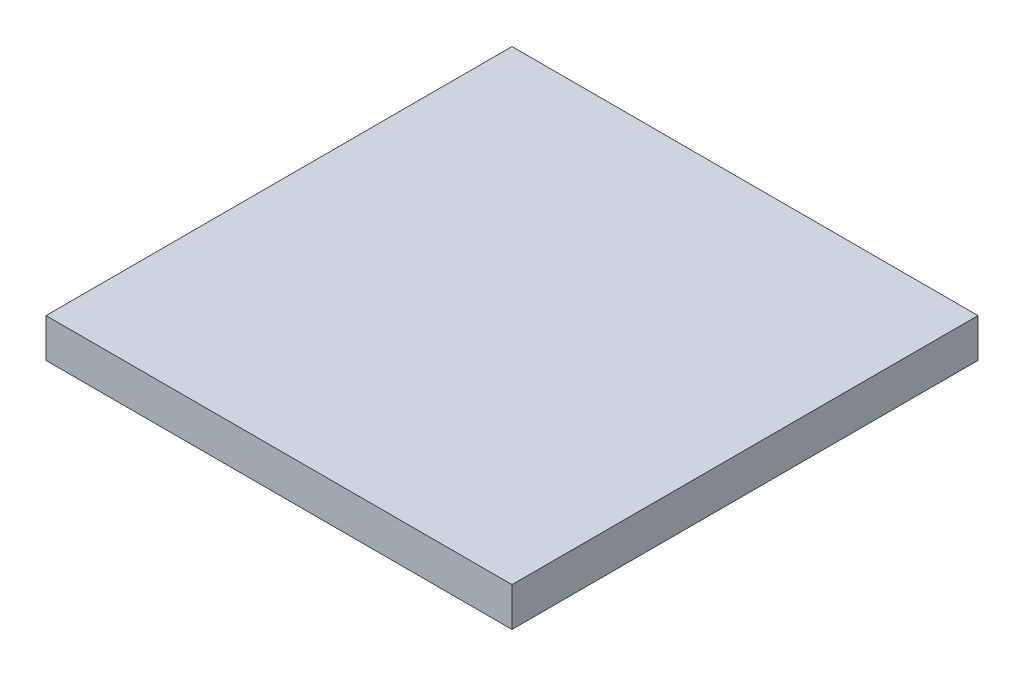
ISO-10303-21;
HEADER;
FILE_DESCRIPTION(('STEP AP214'),'2;1');
FILE_NAME('part.step','',(''),(''),'','','');
FILE_SCHEMA(('AUTOMOTIVE_DESIGN { 1 0 10303 214 1 1 1 1 }'));
ENDSEC;
DATA;
#1=APPLICATION_CONTEXT('core data for automotive mechanical design processes');
#2=APPLICATION_PROTOCOL_DEFINITION('international standard','automotive_design',2000,#1);
#3=PRODUCT_CONTEXT('',#1,'mechanical');
#4=PRODUCT('Part','Part','',(#3));
#5=PRODUCT_RELATED_PRODUCT_CATEGORY('part','',(#4));
#6=PRODUCT_DEFINITION_FORMATION('','',#4);
#7=PRODUCT_DEFINITION_CONTEXT('part definition',#1,'design');
#8=PRODUCT_DEFINITION('design','',#6,#7);
#9=PRODUCT_DEFINITION_SHAPE('','',#8);
#10=(LENGTH_UNIT() NAMED_UNIT(*) SI_UNIT(.MILLI.,.METRE.));
#11=(NAMED_UNIT(*) PLANE_ANGLE_UNIT() SI_UNIT($,.RADIAN.));
#12=(NAMED_UNIT(*) SI_UNIT($,.STERADIAN.) SOLID_ANGLE_UNIT());
#13=UNCERTAINTY_MEASURE_WITH_UNIT(LENGTH_MEASURE(1.E-05),#10,'distance_accuracy_value','');
#14=(GEOMETRIC_REPRESENTATION_CONTEXT(3) GLOBAL_UNCERTAINTY_ASSIGNED_CONTEXT((#13)) GLOBAL_UNIT_ASSIGNED_CONTEXT((#10,
#11,#12)) REPRESENTATION_CONTEXT('',''));
#15=CARTESIAN_POINT('',(0.,0.,0.));
#16=DIRECTION('',(0.,0.,1.));
#17=DIRECTION('',(1.,0.,0.));
#18=AXIS2_PLACEMENT_3D('',#15,#16,#17);
#19=CARTESIAN_POINT('',(0.,200.,0.));
#20=DIRECTION('',(1.,0.,0.));
#21=DIRECTION('',(0.,0.,-1.));
#22=AXIS2_PLACEMENT_3D('',#19,#20,#21);
#23=PLANE('',#22);
#24=DIRECTION('',(0.,0.,1.));
#25=VECTOR('',#24,1.);
#26=CARTESIAN_POINT('',(0.,0.,0.));
#27=LINE('',#26,#25);
#28=CARTESIAN_POINT('',(0.,0.,-2400.));
#29=VERTEX_POINT('',#28);
#30=CARTESIAN_POINT('',(0.,0.,0.));
#31=VERTEX_POINT('',#30);
#32=EDGE_CURVE('E97',#29,#31,#27,.T.);
#33=ORIENTED_EDGE('',*,*,#32,.T.);
#34=DIRECTION('',(0.,-1.,0.));
#35=VECTOR('',#34,1.);
#36=CARTESIAN_POINT('',(0.,200.,0.));
#37=LINE('',#36,#35);
#38=CARTESIAN_POINT('',(0.,200.,0.));
#39=VERTEX_POINT('',#38);
#40=EDGE_CURVE('E11',#39,#31,#37,.T.);
#41=ORIENTED_EDGE('',*,*,#40,.F.);
#42=DIRECTION('',(0.,0.,1.));
#43=VECTOR('',#42,1.);
#44=CARTESIAN_POINT('',(0.,200.,0.));
#45=LINE('',#44,#43);
#46=CARTESIAN_POINT('',(0.,200.,-2400.));
#47=VERTEX_POINT('',#46);
#48=EDGE_CURVE('E85',#47,#39,#45,.T.);
#49=ORIENTED_EDGE('',*,*,#48,.F.);
#50=DIRECTION('',(0.,-1.,0.));
#51=VECTOR('',#50,1.);
#52=CARTESIAN_POINT('',(0.,200.,-2400.));
#53=LINE('',#52,#51);
#54=EDGE_CURVE('E93',#47,#29,#53,.T.);
#55=ORIENTED_EDGE('',*,*,#54,.T.);
#56=EDGE_LOOP('',(#33,#41,#49,#55));
#57=FACE_BOUND('',#56,.T.);
#58=ADVANCED_FACE('F34',(#57),#23,.F.);
#59=CARTESIAN_POINT('',(0.,200.,0.));
#60=DIRECTION('',(0.,0.,-1.));
#61=DIRECTION('',(-1.,0.,0.));
#62=AXIS2_PLACEMENT_3D('',#59,#60,#61);
#63=PLANE('',#62);
#64=DIRECTION('',(1.,0.,0.));
#65=VECTOR('',#64,1.);
#66=CARTESIAN_POINT('',(0.,0.,0.));
#67=LINE('',#66,#65);
#68=CARTESIAN_POINT('',(2400.,0.,0.));
#69=VERTEX_POINT('',#68);
#70=EDGE_CURVE('E89',#31,#69,#67,.T.);
#71=ORIENTED_EDGE('',*,*,#70,.T.);
#72=DIRECTION('',(0.,-1.,0.));
#73=VECTOR('',#72,1.);
#74=CARTESIAN_POINT('',(2400.,200.,0.));
#75=LINE('',#74,#73);
#76=CARTESIAN_POINT('',(2400.,200.,0.));
#77=VERTEX_POINT('',#76);
#78=EDGE_CURVE('E42',#77,#69,#75,.T.);
#79=ORIENTED_EDGE('',*,*,#78,.F.);
#80=DIRECTION('',(1.,0.,0.));
#81=VECTOR('',#80,1.);
#82=CARTESIAN_POINT('',(0.,200.,0.));
#83=LINE('',#82,#81);
#84=EDGE_CURVE('E80',#39,#77,#83,.T.);
#85=ORIENTED_EDGE('',*,*,#84,.F.);
#86=ORIENTED_EDGE('',*,*,#40,.T.);
#87=EDGE_LOOP('',(#71,#79,#85,#86));
#88=FACE_BOUND('',#87,.T.);
#89=ADVANCED_FACE('F88',(#88),#63,.F.);
#90=CARTESIAN_POINT('',(2400.,200.,0.));
#91=DIRECTION('',(-1.,0.,0.));
#92=DIRECTION('',(0.,0.,1.));
#93=AXIS2_PLACEMENT_3D('',#90,#91,#92);
#94=PLANE('',#93);
#95=DIRECTION('',(0.,0.,-1.));
#96=VECTOR('',#95,1.);
#97=CARTESIAN_POINT('',(2400.,0.,0.));
#98=LINE('',#97,#96);
#99=CARTESIAN_POINT('',(2400.,0.,-2400.));
#100=VERTEX_POINT('',#99);
#101=EDGE_CURVE('E67',#69,#100,#98,.T.);
#102=ORIENTED_EDGE('',*,*,#101,.T.);
#103=DIRECTION('',(0.,-1.,0.));
#104=VECTOR('',#103,1.);
#105=CARTESIAN_POINT('',(2400.,200.,-2400.));
#106=LINE('',#105,#104);
#107=CARTESIAN_POINT('',(2400.,200.,-2400.));
#108=VERTEX_POINT('',#107);
#109=EDGE_CURVE('E90',#108,#100,#106,.T.);
#110=ORIENTED_EDGE('',*,*,#109,.F.);
#111=DIRECTION('',(0.,0.,-1.));
#112=VECTOR('',#111,1.);
#113=CARTESIAN_POINT('',(2400.,200.,0.));
#114=LINE('',#113,#112);
#115=EDGE_CURVE('E83',#77,#108,#114,.T.);
#116=ORIENTED_EDGE('',*,*,#115,.F.);
#117=ORIENTED_EDGE('',*,*,#78,.T.);
#118=EDGE_LOOP('',(#102,#110,#116,#117));
#119=FACE_BOUND('',#118,.T.);
#120=ADVANCED_FACE('F91',(#119),#94,.F.);
#121=CARTESIAN_POINT('',(0.,200.,-2400.));
#122=DIRECTION('',(0.,0.,1.));
#123=DIRECTION('',(1.,0.,0.));
#124=AXIS2_PLACEMENT_3D('',#121,#122,#123);
#125=PLANE('',#124);
#126=DIRECTION('',(-1.,0.,0.));
#127=VECTOR('',#126,1.);
#128=CARTESIAN_POINT('',(0.,0.,-2400.));
#129=LINE('',#128,#127);
#130=EDGE_CURVE('E73',#100,#29,#129,.T.);
#131=ORIENTED_EDGE('',*,*,#130,.T.);
#132=ORIENTED_EDGE('',*,*,#54,.F.);
#133=DIRECTION('',(-1.,0.,0.));
#134=VECTOR('',#133,1.);
#135=CARTESIAN_POINT('',(0.,200.,-2400.));
#136=LINE('',#135,#134);
#137=EDGE_CURVE('E50',#108,#47,#136,.T.);
#138=ORIENTED_EDGE('',*,*,#137,.F.);
#139=ORIENTED_EDGE('',*,*,#109,.T.);
#140=EDGE_LOOP('',(#131,#132,#138,#139));
#141=FACE_BOUND('',#140,.T.);
#142=ADVANCED_FACE('F104',(#141),#125,.F.);
#143=CARTESIAN_POINT('',(0.,200.,0.));
#144=DIRECTION('',(0.,-1.,0.));
#145=DIRECTION('',(0.,0.,-1.));
#146=AXIS2_PLACEMENT_3D('',#143,#144,#145);
#147=PLANE('',#146);
#148=ORIENTED_EDGE('',*,*,#48,.T.);
#149=ORIENTED_EDGE('',*,*,#84,.T.);
#150=ORIENTED_EDGE('',*,*,#115,.T.);
#151=ORIENTED_EDGE('',*,*,#137,.T.);
#152=EDGE_LOOP('',(#148,#149,#150,#151));
#153=FACE_BOUND('',#152,.T.);
#154=ADVANCED_FACE('F81',(#153),#147,.F.);
#155=CARTESIAN_POINT('',(0.,0.,0.));
#156=DIRECTION('',(0.,-1.,0.));
#157=DIRECTION('',(0.,0.,-1.));
#158=AXIS2_PLACEMENT_3D('',#155,#156,#157);
#159=PLANE('',#158);
#160=ORIENTED_EDGE('',*,*,#32,.F.);
#161=ORIENTED_EDGE('',*,*,#130,.F.);
#162=ORIENTED_EDGE('',*,*,#101,.F.);
#163=ORIENTED_EDGE('',*,*,#70,.F.);
#164=EDGE_LOOP('',(#160,#161,#162,#163));
#165=FACE_BOUND('',#164,.T.);
#166=ADVANCED_FACE('F107',(#165),#159,.T.);
#167=CLOSED_SHELL('',(#58,#89,#120,#142,#154,#166));
#168=MANIFOLD_SOLID_BREP('B2',#167);
#169=ADVANCED_BREP_SHAPE_REPRESENTATION('',(#18,#168),#14);
#170=SHAPE_DEFINITION_REPRESENTATION(#9,#169);
ENDSEC;
END-ISO-10303-21;
